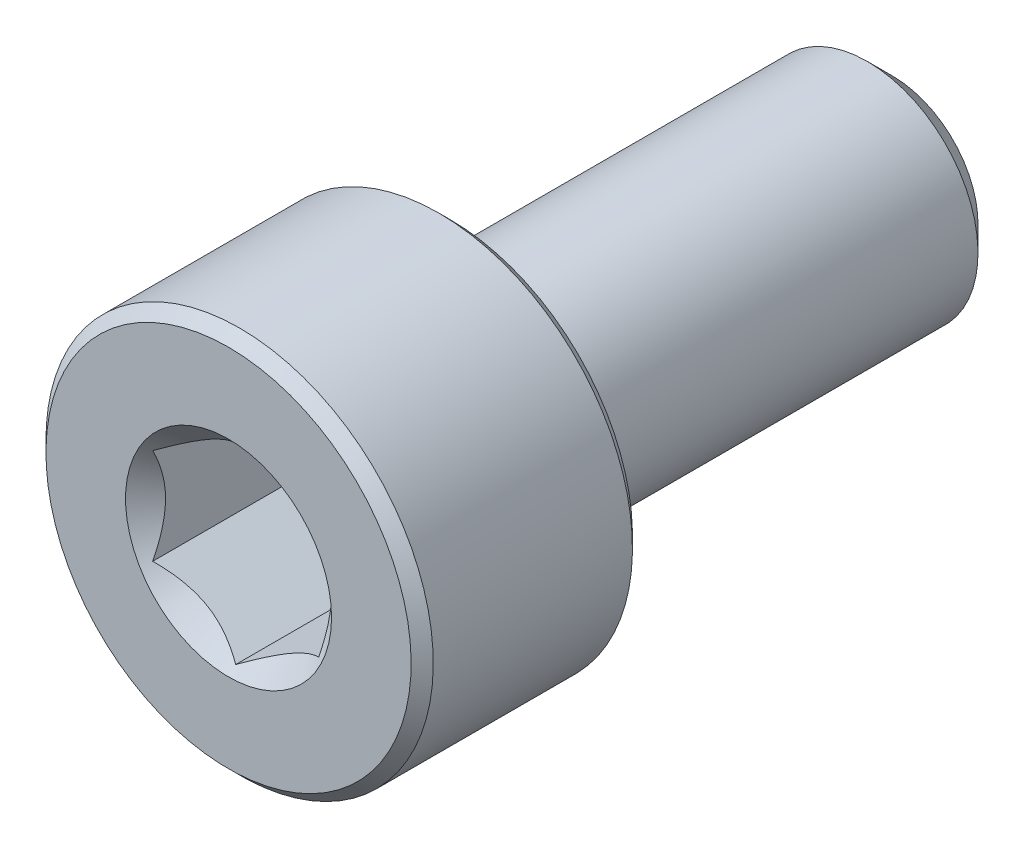
ISO-10303-21;
HEADER;
FILE_DESCRIPTION(('STEP AP214'),'2;1');
FILE_NAME('part.step','',(''),(''),'','','');
FILE_SCHEMA(('AUTOMOTIVE_DESIGN { 1 0 10303 214 1 1 1 1 }'));
ENDSEC;
DATA;
#1=APPLICATION_CONTEXT('core data for automotive mechanical design processes');
#2=APPLICATION_PROTOCOL_DEFINITION('international standard','automotive_design',2000,#1);
#3=PRODUCT_CONTEXT('',#1,'mechanical');
#4=PRODUCT('Part','Part','',(#3));
#5=PRODUCT_RELATED_PRODUCT_CATEGORY('part','',(#4));
#6=PRODUCT_DEFINITION_FORMATION('','',#4);
#7=PRODUCT_DEFINITION_CONTEXT('part definition',#1,'design');
#8=PRODUCT_DEFINITION('design','',#6,#7);
#9=PRODUCT_DEFINITION_SHAPE('','',#8);
#10=(LENGTH_UNIT() NAMED_UNIT(*) SI_UNIT(.MILLI.,.METRE.));
#11=(NAMED_UNIT(*) PLANE_ANGLE_UNIT() SI_UNIT($,.RADIAN.));
#12=(NAMED_UNIT(*) SI_UNIT($,.STERADIAN.) SOLID_ANGLE_UNIT());
#13=UNCERTAINTY_MEASURE_WITH_UNIT(LENGTH_MEASURE(1.E-05),#10,'distance_accuracy_value','');
#14=(GEOMETRIC_REPRESENTATION_CONTEXT(3) GLOBAL_UNCERTAINTY_ASSIGNED_CONTEXT((#13)) GLOBAL_UNIT_ASSIGNED_CONTEXT((#10,
#11,#12)) REPRESENTATION_CONTEXT('',''));
#15=CARTESIAN_POINT('',(0.,0.,0.));
#16=DIRECTION('',(0.,0.,1.));
#17=DIRECTION('',(1.,0.,0.));
#18=AXIS2_PLACEMENT_3D('',#15,#16,#17);
#19=CARTESIAN_POINT('',(0.,1.54533666301317,-6.));
#20=DIRECTION('',(0.,0.,-1.));
#21=DIRECTION('',(0.,1.,0.));
#22=AXIS2_PLACEMENT_3D('',#19,#20,#21);
#23=PLANE('',#22);
#24=CARTESIAN_POINT('',(0.,0.,-6.));
#25=DIRECTION('',(0.,0.,-1.));
#26=DIRECTION('',(0.,1.,0.));
#27=AXIS2_PLACEMENT_3D('',#24,#25,#26);
#28=CIRCLE('',#27,1.54533666301317);
#29=CARTESIAN_POINT('',(0.,1.54533666301317,-6.));
#30=VERTEX_POINT('',#29);
#31=EDGE_CURVE('E55',#30,#30,#28,.T.);
#32=ORIENTED_EDGE('',*,*,#31,.T.);
#33=EDGE_LOOP('',(#32));
#34=FACE_BOUND('',#33,.T.);
#35=ADVANCED_FACE('F41',(#34),#23,.T.);
#36=CARTESIAN_POINT('',(0.,0.,-6.));
#37=DIRECTION('',(0.,0.,1.));
#38=DIRECTION('',(0.,-1.,0.));
#39=AXIS2_PLACEMENT_3D('',#36,#37,#38);
#40=CONICAL_SURFACE('',#39,1.54533666301317,0.785398163397446);
#41=CARTESIAN_POINT('',(0.,0.,-5.54533666301316));
#42=DIRECTION('',(0.,0.,-1.));
#43=DIRECTION('',(0.,1.,0.));
#44=AXIS2_PLACEMENT_3D('',#41,#42,#43);
#45=CIRCLE('',#44,2.);
#46=CARTESIAN_POINT('',(0.,2.,-5.54533666301316));
#47=VERTEX_POINT('',#46);
#48=EDGE_CURVE('E173',#47,#47,#45,.T.);
#49=ORIENTED_EDGE('',*,*,#48,.T.);
#50=EDGE_LOOP('',(#49));
#51=FACE_BOUND('',#50,.T.);
#52=ORIENTED_EDGE('',*,*,#31,.F.);
#53=EDGE_LOOP('',(#52));
#54=FACE_BOUND('',#53,.T.);
#55=ADVANCED_FACE('F181',(#51,#54),#40,.T.);
#56=CARTESIAN_POINT('',(0.,0.,-6.));
#57=DIRECTION('',(0.,0.,-1.));
#58=DIRECTION('',(0.,1.,0.));
#59=AXIS2_PLACEMENT_3D('',#56,#57,#58);
#60=CYLINDRICAL_SURFACE('',#59,2.);
#61=CARTESIAN_POINT('',(0.,0.,1.8));
#62=DIRECTION('',(0.,0.,-1.));
#63=DIRECTION('',(0.,1.,0.));
#64=AXIS2_PLACEMENT_3D('',#61,#62,#63);
#65=CIRCLE('',#64,2.);
#66=CARTESIAN_POINT('',(0.,2.,1.8));
#67=VERTEX_POINT('',#66);
#68=EDGE_CURVE('E169',#67,#67,#65,.T.);
#69=ORIENTED_EDGE('',*,*,#68,.T.);
#70=EDGE_LOOP('',(#69));
#71=FACE_BOUND('',#70,.T.);
#72=ORIENTED_EDGE('',*,*,#48,.F.);
#73=EDGE_LOOP('',(#72));
#74=FACE_BOUND('',#73,.T.);
#75=ADVANCED_FACE('F183',(#71,#74),#60,.T.);
#76=CARTESIAN_POINT('',(0.,0.,1.8));
#77=DIRECTION('',(0.,0.,-1.));
#78=DIRECTION('',(0.,1.,0.));
#79=AXIS2_PLACEMENT_3D('',#76,#77,#78);
#80=TOROIDAL_SURFACE('',#79,2.2,0.2);
#81=CARTESIAN_POINT('',(0.,0.,2.));
#82=DIRECTION('',(0.,0.,-1.));
#83=DIRECTION('',(0.,1.,0.));
#84=AXIS2_PLACEMENT_3D('',#81,#82,#83);
#85=CIRCLE('',#84,2.2);
#86=CARTESIAN_POINT('',(0.,2.2,2.));
#87=VERTEX_POINT('',#86);
#88=EDGE_CURVE('E165',#87,#87,#85,.T.);
#89=ORIENTED_EDGE('',*,*,#88,.T.);
#90=EDGE_LOOP('',(#89));
#91=FACE_BOUND('',#90,.T.);
#92=ORIENTED_EDGE('',*,*,#68,.F.);
#93=EDGE_LOOP('',(#92));
#94=FACE_BOUND('',#93,.T.);
#95=ADVANCED_FACE('F189',(#91,#94),#80,.F.);
#96=CARTESIAN_POINT('',(0.,3.3,2.));
#97=DIRECTION('',(0.,0.,-1.));
#98=DIRECTION('',(0.,1.,0.));
#99=AXIS2_PLACEMENT_3D('',#96,#97,#98);
#100=PLANE('',#99);
#101=CARTESIAN_POINT('',(0.,0.,2.));
#102=DIRECTION('',(0.,0.,-1.));
#103=DIRECTION('',(0.,1.,0.));
#104=AXIS2_PLACEMENT_3D('',#101,#102,#103);
#105=CIRCLE('',#104,3.3);
#106=CARTESIAN_POINT('',(0.,3.3,2.));
#107=VERTEX_POINT('',#106);
#108=EDGE_CURVE('E161',#107,#107,#105,.T.);
#109=ORIENTED_EDGE('',*,*,#108,.T.);
#110=EDGE_LOOP('',(#109));
#111=FACE_BOUND('',#110,.T.);
#112=ORIENTED_EDGE('',*,*,#88,.F.);
#113=EDGE_LOOP('',(#112));
#114=FACE_BOUND('',#113,.T.);
#115=ADVANCED_FACE('F195',(#111,#114),#100,.T.);
#116=CARTESIAN_POINT('',(0.,0.,2.));
#117=DIRECTION('',(0.,0.,1.));
#118=DIRECTION('',(0.,-1.,0.));
#119=AXIS2_PLACEMENT_3D('',#116,#117,#118);
#120=CONICAL_SURFACE('',#119,3.3,0.785398163397447);
#121=CARTESIAN_POINT('',(0.,0.,2.2));
#122=DIRECTION('',(0.,0.,-1.));
#123=DIRECTION('',(0.,1.,0.));
#124=AXIS2_PLACEMENT_3D('',#121,#122,#123);
#125=CIRCLE('',#124,3.5);
#126=CARTESIAN_POINT('',(0.,3.5,2.2));
#127=VERTEX_POINT('',#126);
#128=EDGE_CURVE('E157',#127,#127,#125,.T.);
#129=ORIENTED_EDGE('',*,*,#128,.T.);
#130=EDGE_LOOP('',(#129));
#131=FACE_BOUND('',#130,.T.);
#132=ORIENTED_EDGE('',*,*,#108,.F.);
#133=EDGE_LOOP('',(#132));
#134=FACE_BOUND('',#133,.T.);
#135=ADVANCED_FACE('F199',(#131,#134),#120,.T.);
#136=CARTESIAN_POINT('',(0.,0.,-6.));
#137=DIRECTION('',(0.,0.,-1.));
#138=DIRECTION('',(0.,1.,0.));
#139=AXIS2_PLACEMENT_3D('',#136,#137,#138);
#140=CYLINDRICAL_SURFACE('',#139,3.5);
#141=CARTESIAN_POINT('',(0.,0.,5.8));
#142=DIRECTION('',(0.,0.,-1.));
#143=DIRECTION('',(0.,1.,0.));
#144=AXIS2_PLACEMENT_3D('',#141,#142,#143);
#145=CIRCLE('',#144,3.5);
#146=CARTESIAN_POINT('',(0.,3.5,5.8));
#147=VERTEX_POINT('',#146);
#148=EDGE_CURVE('E153',#147,#147,#145,.T.);
#149=ORIENTED_EDGE('',*,*,#148,.T.);
#150=EDGE_LOOP('',(#149));
#151=FACE_BOUND('',#150,.T.);
#152=ORIENTED_EDGE('',*,*,#128,.F.);
#153=EDGE_LOOP('',(#152));
#154=FACE_BOUND('',#153,.T.);
#155=ADVANCED_FACE('F203',(#151,#154),#140,.T.);
#156=CARTESIAN_POINT('',(0.,0.,5.8));
#157=DIRECTION('',(0.,0.,-1.));
#158=DIRECTION('',(0.,1.,0.));
#159=AXIS2_PLACEMENT_3D('',#156,#157,#158);
#160=CONICAL_SURFACE('',#159,3.5,0.785398163397447);
#161=CARTESIAN_POINT('',(0.,0.,6.));
#162=DIRECTION('',(0.,0.,-1.));
#163=DIRECTION('',(0.,1.,0.));
#164=AXIS2_PLACEMENT_3D('',#161,#162,#163);
#165=CIRCLE('',#164,3.3);
#166=CARTESIAN_POINT('',(0.,3.3,6.));
#167=VERTEX_POINT('',#166);
#168=EDGE_CURVE('E149',#167,#167,#165,.T.);
#169=ORIENTED_EDGE('',*,*,#168,.T.);
#170=EDGE_LOOP('',(#169));
#171=FACE_BOUND('',#170,.T.);
#172=ORIENTED_EDGE('',*,*,#148,.F.);
#173=EDGE_LOOP('',(#172));
#174=FACE_BOUND('',#173,.T.);
#175=ADVANCED_FACE('F207',(#171,#174),#160,.T.);
#176=CARTESIAN_POINT('',(0.,0.,6.));
#177=DIRECTION('',(0.,0.,1.));
#178=DIRECTION('',(0.,-1.,0.));
#179=AXIS2_PLACEMENT_3D('',#176,#177,#178);
#180=PLANE('',#179);
#181=CARTESIAN_POINT('',(0.,0.,6.));
#182=DIRECTION('',(0.,0.,1.));
#183=DIRECTION('',(1.,0.,0.));
#184=AXIS2_PLACEMENT_3D('',#181,#182,#183);
#185=CIRCLE('',#184,1.86195461813654);
#186=CARTESIAN_POINT('',(1.86195461813654,0.,6.));
#187=VERTEX_POINT('',#186);
#188=EDGE_CURVE('E115',#187,#187,#185,.T.);
#189=ORIENTED_EDGE('',*,*,#188,.F.);
#190=EDGE_LOOP('',(#189));
#191=FACE_BOUND('',#190,.T.);
#192=ORIENTED_EDGE('',*,*,#168,.F.);
#193=EDGE_LOOP('',(#192));
#194=FACE_BOUND('',#193,.T.);
#195=ADVANCED_FACE('F211',(#191,#194),#180,.T.);
#196=CARTESIAN_POINT('',(0.,0.,6.));
#197=DIRECTION('',(0.,0.,1.));
#198=DIRECTION('',(1.,0.,0.));
#199=AXIS2_PLACEMENT_3D('',#196,#197,#198);
#200=CONICAL_SURFACE('',#199,1.86195461813654,0.78539816339745);
#201=ORIENTED_EDGE('',*,*,#188,.T.);
#202=EDGE_LOOP('',(#201));
#203=FACE_BOUND('',#202,.T.);
#204=CARTESIAN_POINT('',(-0.000199999999999562,-1.73216627762272,5.87021167103241));
#205=CARTESIAN_POINT('',(0.051367790737076,-1.70239359975915,5.84046166549966));
#206=CARTESIAN_POINT('',(0.103797917665201,-1.67212305186355,5.81245867334265));
#207=CARTESIAN_POINT('',(0.210709034055597,-1.61039789003619,5.76118541987248));
#208=CARTESIAN_POINT('',(0.265200195814661,-1.57893740312614,5.73794369447671));
#209=CARTESIAN_POINT('',(0.375079081357249,-1.51549879897987,5.69812991842455));
#210=CARTESIAN_POINT('',(0.4304388090952,-1.4835368452681,5.68145777510323));
#211=CARTESIAN_POINT('',(0.542377257477151,-1.41890915196211,5.65577064625044));
#212=CARTESIAN_POINT('',(0.598952556553009,-1.38624538781118,5.6467364799112));
#213=CARTESIAN_POINT('',(0.696455389516441,-1.32995210095299,5.63858527065919));
#214=CARTESIAN_POINT('',(0.737256908280467,-1.30639533311124,5.63737844242155));
#215=CARTESIAN_POINT('',(0.818787969615859,-1.25932335290193,5.6394102465946));
#216=CARTESIAN_POINT('',(0.859517494314631,-1.23580815085313,5.64264986018064));
#217=CARTESIAN_POINT('',(0.940584402163417,-1.18900414978427,5.6533881754143));
#218=CARTESIAN_POINT('',(0.980921384598289,-1.1657155821172,5.66089084245107));
#219=CARTESIAN_POINT('',(1.06091833691403,-1.11952932016335,5.67974780136062));
#220=CARTESIAN_POINT('',(1.10057800851621,-1.09663179808786,5.69110374645092));
#221=CARTESIAN_POINT('',(1.20216313477449,-1.03798159809698,5.72481783702501));
#222=CARTESIAN_POINT('',(1.26345855370969,-1.00259267147465,5.7497180385257));
#223=CARTESIAN_POINT('',(1.35358562846331,-0.950557780604375,5.79175284270391));
#224=CARTESIAN_POINT('',(1.38328513990772,-0.933410759677147,5.80652134299143));
#225=CARTESIAN_POINT('',(1.44213790138375,-0.899432101996407,5.8374067553725));
#226=CARTESIAN_POINT('',(1.47129140422064,-0.88260031928571,5.85352302355404));
#227=CARTESIAN_POINT('',(1.5002,-0.865909933730601,5.87021167103241));
#228=B_SPLINE_CURVE_WITH_KNOTS('',3,(#204,#205,#206,#207,#208,#209,#210,#211,#212,#213,#214,
#215,#216,#217,#218,#219,#220,#221,#222,#223,#224,#225,#226,#227),.UNSPECIFIED.,.F.,.F.,(4,2,2,
2,2,2,2,2,2,2,2,4),(0.,0.199829143693305,0.400822987382388,0.598623720538181,0.79592624018889,
0.937113067959882,1.07833105577193,1.21968061668222,1.36109089931054,1.58570969637565,
1.69770705470964,1.80965120737194),.UNSPECIFIED.);
#229=CARTESIAN_POINT('',(0.,-1.73205080756888,5.87009618943233));
#230=VERTEX_POINT('',#229);
#231=CARTESIAN_POINT('',(1.5,-0.866025403784439,5.87009618943233));
#232=VERTEX_POINT('',#231);
#233=EDGE_CURVE('E12',#230,#232,#228,.T.);
#234=ORIENTED_EDGE('',*,*,#233,.F.);
#235=CARTESIAN_POINT('',(-1.5002,-0.865909933730601,5.87021167103241));
#236=CARTESIAN_POINT('',(-1.44863220926292,-0.895682611594166,5.84046166549966));
#237=CARTESIAN_POINT('',(-1.3962020823348,-0.925953159489765,5.81245867334265));
#238=CARTESIAN_POINT('',(-1.2892909659444,-0.987678321317124,5.76118541987248));
#239=CARTESIAN_POINT('',(-1.23479980418534,-1.01913880822718,5.73794369447671));
#240=CARTESIAN_POINT('',(-1.12492091864275,-1.08257741237344,5.69812991842455));
#241=CARTESIAN_POINT('',(-1.0695611909048,-1.11453936608521,5.68145777510323));
#242=CARTESIAN_POINT('',(-0.957622742522849,-1.1791670593912,5.65577064625044));
#243=CARTESIAN_POINT('',(-0.901047443446991,-1.21183082354213,5.6467364799112));
#244=CARTESIAN_POINT('',(-0.803544610483559,-1.26812411040032,5.63858527065919));
#245=CARTESIAN_POINT('',(-0.762743091719534,-1.29168087824208,5.63737844242155));
#246=CARTESIAN_POINT('',(-0.681212030384142,-1.33875285845138,5.6394102465946));
#247=CARTESIAN_POINT('',(-0.64048250568537,-1.36226806050018,5.64264986018064));
#248=CARTESIAN_POINT('',(-0.559415597836584,-1.40907206156905,5.6533881754143));
#249=CARTESIAN_POINT('',(-0.519078615401712,-1.43236062923612,5.66089084245107));
#250=CARTESIAN_POINT('',(-0.439081663085969,-1.47854689118996,5.67974780136062));
#251=CARTESIAN_POINT('',(-0.399421991483792,-1.50144441326545,5.69110374645092));
#252=CARTESIAN_POINT('',(-0.297836865225515,-1.56009461325633,5.72481783702501));
#253=CARTESIAN_POINT('',(-0.236541446290311,-1.59548353987866,5.7497180385257));
#254=CARTESIAN_POINT('',(-0.146414371536686,-1.64751843074894,5.79175284270391));
#255=CARTESIAN_POINT('',(-0.116714860092282,-1.66466545167617,5.80652134299143));
#256=CARTESIAN_POINT('',(-0.0578620986162482,-1.69864410935691,5.8374067553725));
#257=CARTESIAN_POINT('',(-0.0287085957793619,-1.71547589206761,5.85352302355404));
#258=CARTESIAN_POINT('',(0.00020000000000074,-1.73216627762272,5.87021167103241));
#259=B_SPLINE_CURVE_WITH_KNOTS('',3,(#235,#236,#237,#238,#239,#240,#241,#242,#243,#244,#245,
#246,#247,#248,#249,#250,#251,#252,#253,#254,#255,#256,#257,#258),.UNSPECIFIED.,.F.,.F.,(4,2,2,
2,2,2,2,2,2,2,2,4),(0.,0.199829143693305,0.400822987382388,0.598623720538181,0.795926240188889,
0.937113067959881,1.07833105577193,1.21968061668222,1.36109089931054,1.58570969637566,
1.69770705470964,1.80965120737194),.UNSPECIFIED.);
#260=CARTESIAN_POINT('',(-1.5,-0.866025403784439,5.87009618943233));
#261=VERTEX_POINT('',#260);
#262=EDGE_CURVE('E100',#261,#230,#259,.T.);
#263=ORIENTED_EDGE('',*,*,#262,.F.);
#264=CARTESIAN_POINT('',(-1.5,-1.81798631684901,6.49496588290931));
#265=CARTESIAN_POINT('',(-1.5,-1.77410479833239,6.46112335419702));
#266=CARTESIAN_POINT('',(-1.5,-1.72998897047494,6.42758561768896));
#267=CARTESIAN_POINT('',(-1.5,-1.64119029432319,6.36124817349268));
#268=CARTESIAN_POINT('',(-1.5,-1.59650731534755,6.328448640911));
#269=CARTESIAN_POINT('',(-1.5,-1.460806940489,6.23088193148043));
#270=CARTESIAN_POINT('',(-1.5,-1.36880251235632,6.1674654206559));
#271=CARTESIAN_POINT('',(-1.5,-1.17526237686872,6.04210237172158));
#272=CARTESIAN_POINT('',(-1.5,-1.07349393006072,5.98051141536721));
#273=CARTESIAN_POINT('',(-1.5,-0.864764842560628,5.86725220599653));
#274=CARTESIAN_POINT('',(-1.5,-0.75782333444995,5.81555043950584));
#275=CARTESIAN_POINT('',(-1.5,-0.598146069886858,5.75227317361643));
#276=CARTESIAN_POINT('',(-1.5,-0.547969945491557,5.73427408399123));
#277=CARTESIAN_POINT('',(-1.5,-0.446326869364775,5.70229546522083));
#278=CARTESIAN_POINT('',(-1.5,-0.394859836419925,5.6883161896624));
#279=CARTESIAN_POINT('',(-1.5,-0.291848397493325,5.66536569037263));
#280=CARTESIAN_POINT('',(-1.5,-0.240324749628771,5.65630281543282));
#281=CARTESIAN_POINT('',(-1.5,-0.13662544851591,5.64337711521516));
#282=CARTESIAN_POINT('',(-1.5,-0.0844499362377799,5.6395131846234));
#283=CARTESIAN_POINT('',(-1.5,0.0176806967011132,5.63731961256892));
#284=CARTESIAN_POINT('',(-1.5,0.0676307045116618,5.63875006923659));
#285=CARTESIAN_POINT('',(-1.5,0.16714547763776,5.64651331423855));
#286=CARTESIAN_POINT('',(-1.5,0.216710207908513,5.6528465433779));
#287=CARTESIAN_POINT('',(-1.5,0.315937150651982,5.67016271707146));
#288=CARTESIAN_POINT('',(-1.5,0.365584733694539,5.68122815181031));
#289=CARTESIAN_POINT('',(-1.5,0.46378160619877,5.70739349919907));
#290=CARTESIAN_POINT('',(-1.5,0.512330953840259,5.72249319758548));
#291=CARTESIAN_POINT('',(-1.5,0.66131302328769,5.77461385569168));
#292=CARTESIAN_POINT('',(-1.5,0.759720789706277,5.81740496304236));
#293=CARTESIAN_POINT('',(-1.5,0.95194266902277,5.91263883721007));
#294=CARTESIAN_POINT('',(-1.5,1.04573912191844,5.96511552648595));
#295=CARTESIAN_POINT('',(-1.5,1.22504153577549,6.0734783373155));
#296=CARTESIAN_POINT('',(-1.5,1.3107282773288,6.12906910554414));
#297=CARTESIAN_POINT('',(-1.5,1.43696960041027,6.21505045621636));
#298=CARTESIAN_POINT('',(-1.5,1.47850725450332,6.24402268297088));
#299=CARTESIAN_POINT('',(-1.5,1.56101250374723,6.30274488393776));
#300=CARTESIAN_POINT('',(-1.5,1.60198025290925,6.3324946415183));
#301=CARTESIAN_POINT('',(-1.5,1.64271029717086,6.36256715528604));
#302=B_SPLINE_CURVE_WITH_KNOTS('',3,(#264,#265,#266,#267,#268,#269,#270,#271,#272,#273,#274,
#275,#276,#277,#278,#279,#280,#281,#282,#283,#284,#285,#286,#287,#288,#289,#290,#291,#292,#293,
#294,#295,#296,#297,#298,#299,#300,#301),.UNSPECIFIED.,.F.,.F.,(4,2,2,2,2,2,2,2,2,2,2,2,2,2,2,2,
2,2,4),(0.,0.166243250325255,0.332525527595494,0.667617582874064,1.02421660314856,
1.37958485991001,1.53937185590113,1.69916892971772,1.85587466130012,2.01254707142443,
2.16220898927398,2.31188436469119,2.46428258498153,2.61667271286895,2.93766301623296,
3.25979964661299,3.56606529199603,3.71798989158865,3.86987260467919),.UNSPECIFIED.);
#303=CARTESIAN_POINT('',(-1.5,0.866025403784439,5.87009618943233));
#304=VERTEX_POINT('',#303);
#305=EDGE_CURVE('E114',#304,#261,#302,.F.);
#306=ORIENTED_EDGE('',*,*,#305,.F.);
#307=CARTESIAN_POINT('',(0.00019999999999977,1.73216627762272,5.87021167103241));
#308=CARTESIAN_POINT('',(-0.0513677907370758,1.70239359975915,5.84046166549966));
#309=CARTESIAN_POINT('',(-0.103797917665201,1.67212305186355,5.81245867334265));
#310=CARTESIAN_POINT('',(-0.210709034055597,1.61039789003619,5.76118541987248));
#311=CARTESIAN_POINT('',(-0.265200195814661,1.57893740312614,5.73794369447671));
#312=CARTESIAN_POINT('',(-0.375079081357249,1.51549879897987,5.69812991842455));
#313=CARTESIAN_POINT('',(-0.4304388090952,1.4835368452681,5.68145777510323));
#314=CARTESIAN_POINT('',(-0.542377257477151,1.41890915196211,5.65577064625044));
#315=CARTESIAN_POINT('',(-0.598952556553009,1.38624538781118,5.6467364799112));
#316=CARTESIAN_POINT('',(-0.696455389516441,1.32995210095299,5.63858527065919));
#317=CARTESIAN_POINT('',(-0.737256908280467,1.30639533311124,5.63737844242155));
#318=CARTESIAN_POINT('',(-0.818787969615859,1.25932335290193,5.6394102465946));
#319=CARTESIAN_POINT('',(-0.859517494314631,1.23580815085313,5.64264986018064));
#320=CARTESIAN_POINT('',(-0.940584402163417,1.18900414978427,5.6533881754143));
#321=CARTESIAN_POINT('',(-0.980921384598289,1.16571558211719,5.66089084245107));
#322=CARTESIAN_POINT('',(-1.06091833691403,1.11952932016335,5.67974780136062));
#323=CARTESIAN_POINT('',(-1.10057800851621,1.09663179808786,5.69110374645092));
#324=CARTESIAN_POINT('',(-1.20216313477449,1.03798159809698,5.72481783702501));
#325=CARTESIAN_POINT('',(-1.26345855370969,1.00259267147465,5.7497180385257));
#326=CARTESIAN_POINT('',(-1.35358562846331,0.950557780604374,5.79175284270391));
#327=CARTESIAN_POINT('',(-1.38328513990772,0.933410759677147,5.80652134299143));
#328=CARTESIAN_POINT('',(-1.44213790138375,0.899432101996406,5.8374067553725));
#329=CARTESIAN_POINT('',(-1.47129140422064,0.88260031928571,5.85352302355404));
#330=CARTESIAN_POINT('',(-1.5002,0.865909933730601,5.87021167103241));
#331=B_SPLINE_CURVE_WITH_KNOTS('',3,(#307,#308,#309,#310,#311,#312,#313,#314,#315,#316,#317,
#318,#319,#320,#321,#322,#323,#324,#325,#326,#327,#328,#329,#330),.UNSPECIFIED.,.F.,.F.,(4,2,2,
2,2,2,2,2,2,2,2,4),(0.,0.199829143693305,0.400822987382389,0.598623720538181,0.79592624018889,
0.937113067959882,1.07833105577193,1.21968061668222,1.36109089931055,1.58570969637566,
1.69770705470964,1.80965120737194),.UNSPECIFIED.);
#332=CARTESIAN_POINT('',(0.,1.73205080756888,5.87009618943233));
#333=VERTEX_POINT('',#332);
#334=EDGE_CURVE('E262',#333,#304,#331,.T.);
#335=ORIENTED_EDGE('',*,*,#334,.F.);
#336=CARTESIAN_POINT('',(1.5002,0.865909933730601,5.87021167103241));
#337=CARTESIAN_POINT('',(1.44863220926292,0.895682611594166,5.84046166549966));
#338=CARTESIAN_POINT('',(1.3962020823348,0.925953159489765,5.81245867334265));
#339=CARTESIAN_POINT('',(1.2892909659444,0.987678321317124,5.76118541987248));
#340=CARTESIAN_POINT('',(1.23479980418534,1.01913880822718,5.73794369447671));
#341=CARTESIAN_POINT('',(1.12492091864275,1.08257741237344,5.69812991842455));
#342=CARTESIAN_POINT('',(1.0695611909048,1.11453936608521,5.68145777510323));
#343=CARTESIAN_POINT('',(0.957622742522849,1.1791670593912,5.65577064625044));
#344=CARTESIAN_POINT('',(0.901047443446991,1.21183082354213,5.6467364799112));
#345=CARTESIAN_POINT('',(0.803544610483559,1.26812411040032,5.63858527065919));
#346=CARTESIAN_POINT('',(0.762743091719534,1.29168087824208,5.63737844242155));
#347=CARTESIAN_POINT('',(0.681212030384142,1.33875285845138,5.6394102465946));
#348=CARTESIAN_POINT('',(0.64048250568537,1.36226806050018,5.64264986018064));
#349=CARTESIAN_POINT('',(0.559415597836584,1.40907206156905,5.6533881754143));
#350=CARTESIAN_POINT('',(0.519078615401712,1.43236062923612,5.66089084245107));
#351=CARTESIAN_POINT('',(0.439081663085969,1.47854689118996,5.67974780136062));
#352=CARTESIAN_POINT('',(0.399421991483792,1.50144441326545,5.69110374645092));
#353=CARTESIAN_POINT('',(0.297836865225515,1.56009461325633,5.72481783702501));
#354=CARTESIAN_POINT('',(0.23654144629031,1.59548353987866,5.7497180385257));
#355=CARTESIAN_POINT('',(0.146414371536686,1.64751843074894,5.79175284270391));
#356=CARTESIAN_POINT('',(0.116714860092281,1.66466545167617,5.80652134299143));
#357=CARTESIAN_POINT('',(0.0578620986162482,1.69864410935691,5.8374067553725));
#358=CARTESIAN_POINT('',(0.028708595779362,1.71547589206761,5.85352302355404));
#359=CARTESIAN_POINT('',(-0.000200000000000716,1.73216627762272,5.87021167103241));
#360=B_SPLINE_CURVE_WITH_KNOTS('',3,(#336,#337,#338,#339,#340,#341,#342,#343,#344,#345,#346,
#347,#348,#349,#350,#351,#352,#353,#354,#355,#356,#357,#358,#359),.UNSPECIFIED.,.F.,.F.,(4,2,2,
2,2,2,2,2,2,2,2,4),(0.,0.199829143693305,0.400822987382389,0.598623720538181,0.795926240188889,
0.937113067959881,1.07833105577193,1.21968061668222,1.36109089931054,1.58570969637566,
1.69770705470964,1.80965120737194),.UNSPECIFIED.);
#361=CARTESIAN_POINT('',(1.5,0.866025403784439,5.87009618943233));
#362=VERTEX_POINT('',#361);
#363=EDGE_CURVE('E235',#362,#333,#360,.T.);
#364=ORIENTED_EDGE('',*,*,#363,.F.);
#365=CARTESIAN_POINT('',(1.5,-1.81798631684901,6.49496588290931));
#366=CARTESIAN_POINT('',(1.5,-1.77410479833239,6.46112335419702));
#367=CARTESIAN_POINT('',(1.5,-1.72998897047494,6.42758561768896));
#368=CARTESIAN_POINT('',(1.5,-1.64119029432319,6.36124817349268));
#369=CARTESIAN_POINT('',(1.5,-1.59650731534755,6.328448640911));
#370=CARTESIAN_POINT('',(1.5,-1.460806940489,6.23088193148043));
#371=CARTESIAN_POINT('',(1.5,-1.36880251235632,6.1674654206559));
#372=CARTESIAN_POINT('',(1.5,-1.17526237686872,6.04210237172158));
#373=CARTESIAN_POINT('',(1.5,-1.07349393006072,5.98051141536721));
#374=CARTESIAN_POINT('',(1.5,-0.864764842560628,5.86725220599653));
#375=CARTESIAN_POINT('',(1.5,-0.757823334449949,5.81555043950584));
#376=CARTESIAN_POINT('',(1.5,-0.598146069886857,5.75227317361643));
#377=CARTESIAN_POINT('',(1.5,-0.547969945491557,5.73427408399123));
#378=CARTESIAN_POINT('',(1.5,-0.446326869364774,5.70229546522083));
#379=CARTESIAN_POINT('',(1.5,-0.394859836419925,5.6883161896624));
#380=CARTESIAN_POINT('',(1.5,-0.291848397493325,5.66536569037263));
#381=CARTESIAN_POINT('',(1.5,-0.240324749628771,5.65630281543282));
#382=CARTESIAN_POINT('',(1.5,-0.13662544851591,5.64337711521516));
#383=CARTESIAN_POINT('',(1.5,-0.0844499362377801,5.6395131846234));
#384=CARTESIAN_POINT('',(1.5,0.017680696701113,5.63731961256892));
#385=CARTESIAN_POINT('',(1.5,0.0676307045116617,5.63875006923659));
#386=CARTESIAN_POINT('',(1.5,0.16714547763776,5.64651331423855));
#387=CARTESIAN_POINT('',(1.5,0.216710207908513,5.6528465433779));
#388=CARTESIAN_POINT('',(1.5,0.315937150651982,5.67016271707146));
#389=CARTESIAN_POINT('',(1.5,0.365584733694538,5.68122815181031));
#390=CARTESIAN_POINT('',(1.5,0.463781606198769,5.70739349919907));
#391=CARTESIAN_POINT('',(1.5,0.512330953840258,5.72249319758548));
#392=CARTESIAN_POINT('',(1.5,0.66131302328769,5.77461385569168));
#393=CARTESIAN_POINT('',(1.5,0.759720789706276,5.81740496304236));
#394=CARTESIAN_POINT('',(1.5,0.951942669022769,5.91263883721007));
#395=CARTESIAN_POINT('',(1.5,1.04573912191844,5.96511552648595));
#396=CARTESIAN_POINT('',(1.5,1.22504153577548,6.07347833731549));
#397=CARTESIAN_POINT('',(1.5,1.3107282773288,6.12906910554413));
#398=CARTESIAN_POINT('',(1.5,1.43696960041027,6.21505045621636));
#399=CARTESIAN_POINT('',(1.5,1.47850725450332,6.24402268297088));
#400=CARTESIAN_POINT('',(1.5,1.56101250374723,6.30274488393776));
#401=CARTESIAN_POINT('',(1.5,1.60198025290925,6.3324946415183));
#402=CARTESIAN_POINT('',(1.5,1.64271029717086,6.36256715528604));
#403=B_SPLINE_CURVE_WITH_KNOTS('',3,(#365,#366,#367,#368,#369,#370,#371,#372,#373,#374,#375,
#376,#377,#378,#379,#380,#381,#382,#383,#384,#385,#386,#387,#388,#389,#390,#391,#392,#393,#394,
#395,#396,#397,#398,#399,#400,#401,#402),.UNSPECIFIED.,.F.,.F.,(4,2,2,2,2,2,2,2,2,2,2,2,2,2,2,2,
2,2,4),(0.,0.166243250325254,0.332525527595493,0.667617582874062,1.02421660314856,
1.37958485991001,1.53937185590113,1.69916892971772,1.85587466130012,2.01254707142443,
2.16220898927398,2.31188436469119,2.46428258498153,2.61667271286895,2.93766301623296,
3.25979964661299,3.56606529199602,3.71798989158864,3.86987260467919),.UNSPECIFIED.);
#404=EDGE_CURVE('E62',#232,#362,#403,.T.);
#405=ORIENTED_EDGE('',*,*,#404,.F.);
#406=EDGE_LOOP('',(#234,#263,#306,#335,#364,#405));
#407=FACE_BOUND('',#406,.T.);
#408=ADVANCED_FACE('F99',(#203,#407),#200,.F.);
#409=CARTESIAN_POINT('',(0.,3.3,3.));
#410=DIRECTION('',(0.,0.,-1.));
#411=DIRECTION('',(0.,1.,0.));
#412=AXIS2_PLACEMENT_3D('',#409,#410,#411);
#413=PLANE('',#412);
#414=DIRECTION('',(0.866025403784438,0.5,0.));
#415=VECTOR('',#414,1.);
#416=CARTESIAN_POINT('',(0.,-1.73205080756888,3.));
#417=LINE('',#416,#415);
#418=CARTESIAN_POINT('',(0.,-1.73205080756888,3.));
#419=VERTEX_POINT('',#418);
#420=CARTESIAN_POINT('',(1.5,-0.866025403784439,3.));
#421=VERTEX_POINT('',#420);
#422=EDGE_CURVE('E118',#419,#421,#417,.T.);
#423=ORIENTED_EDGE('',*,*,#422,.T.);
#424=DIRECTION('',(0.,1.,0.));
#425=VECTOR('',#424,1.);
#426=CARTESIAN_POINT('',(1.5,-0.866025403784439,3.));
#427=LINE('',#426,#425);
#428=CARTESIAN_POINT('',(1.5,0.866025403784439,3.));
#429=VERTEX_POINT('',#428);
#430=EDGE_CURVE('E69',#421,#429,#427,.T.);
#431=ORIENTED_EDGE('',*,*,#430,.T.);
#432=DIRECTION('',(-0.866025403784439,0.5,0.));
#433=VECTOR('',#432,1.);
#434=CARTESIAN_POINT('',(1.5,0.866025403784439,3.));
#435=LINE('',#434,#433);
#436=CARTESIAN_POINT('',(0.,1.73205080756888,3.));
#437=VERTEX_POINT('',#436);
#438=EDGE_CURVE('E129',#429,#437,#435,.T.);
#439=ORIENTED_EDGE('',*,*,#438,.T.);
#440=DIRECTION('',(-0.866025403784439,-0.5,0.));
#441=VECTOR('',#440,1.);
#442=CARTESIAN_POINT('',(0.,1.73205080756888,3.));
#443=LINE('',#442,#441);
#444=CARTESIAN_POINT('',(-1.5,0.866025403784439,3.));
#445=VERTEX_POINT('',#444);
#446=EDGE_CURVE('E138',#437,#445,#443,.T.);
#447=ORIENTED_EDGE('',*,*,#446,.T.);
#448=DIRECTION('',(0.,-1.,0.));
#449=VECTOR('',#448,1.);
#450=CARTESIAN_POINT('',(-1.5,0.866025403784438,3.));
#451=LINE('',#450,#449);
#452=CARTESIAN_POINT('',(-1.5,-0.866025403784439,3.));
#453=VERTEX_POINT('',#452);
#454=EDGE_CURVE('E133',#445,#453,#451,.T.);
#455=ORIENTED_EDGE('',*,*,#454,.T.);
#456=DIRECTION('',(0.866025403784439,-0.5,0.));
#457=VECTOR('',#456,1.);
#458=CARTESIAN_POINT('',(-1.5,-0.866025403784439,3.));
#459=LINE('',#458,#457);
#460=EDGE_CURVE('E120',#453,#419,#459,.T.);
#461=ORIENTED_EDGE('',*,*,#460,.T.);
#462=EDGE_LOOP('',(#423,#431,#439,#447,#455,#461));
#463=FACE_BOUND('',#462,.T.);
#464=ADVANCED_FACE('F216',(#463),#413,.F.);
#465=CARTESIAN_POINT('',(0.,-1.73205080756888,-2.58257569495584));
#466=DIRECTION('',(0.5,-0.866025403784438,0.));
#467=DIRECTION('',(0.866025403784438,0.5,0.));
#468=AXIS2_PLACEMENT_3D('',#465,#466,#467);
#469=PLANE('',#468);
#470=DIRECTION('',(0.,0.,1.));
#471=VECTOR('',#470,1.);
#472=CARTESIAN_POINT('',(0.,-1.73205080756888,-2.58257569495584));
#473=LINE('',#472,#471);
#474=EDGE_CURVE('E109',#419,#230,#473,.T.);
#475=ORIENTED_EDGE('',*,*,#474,.T.);
#476=ORIENTED_EDGE('',*,*,#233,.T.);
#477=DIRECTION('',(0.,0.,1.));
#478=VECTOR('',#477,1.);
#479=CARTESIAN_POINT('',(1.5,-0.866025403784439,-2.58257569495584));
#480=LINE('',#479,#478);
#481=EDGE_CURVE('E124',#421,#232,#480,.T.);
#482=ORIENTED_EDGE('',*,*,#481,.F.);
#483=ORIENTED_EDGE('',*,*,#422,.F.);
#484=EDGE_LOOP('',(#475,#476,#482,#483));
#485=FACE_BOUND('',#484,.T.);
#486=ADVANCED_FACE('F117',(#485),#469,.F.);
#487=CARTESIAN_POINT('',(-1.5,-0.866025403784439,-2.58257569495584));
#488=DIRECTION('',(-0.5,-0.866025403784439,0.));
#489=DIRECTION('',(0.866025403784439,-0.5,0.));
#490=AXIS2_PLACEMENT_3D('',#487,#488,#489);
#491=PLANE('',#490);
#492=DIRECTION('',(0.,0.,1.));
#493=VECTOR('',#492,1.);
#494=CARTESIAN_POINT('',(-1.5,-0.866025403784439,-2.58257569495584));
#495=LINE('',#494,#493);
#496=EDGE_CURVE('E112',#453,#261,#495,.T.);
#497=ORIENTED_EDGE('',*,*,#496,.T.);
#498=ORIENTED_EDGE('',*,*,#262,.T.);
#499=ORIENTED_EDGE('',*,*,#474,.F.);
#500=ORIENTED_EDGE('',*,*,#460,.F.);
#501=EDGE_LOOP('',(#497,#498,#499,#500));
#502=FACE_BOUND('',#501,.T.);
#503=ADVANCED_FACE('F108',(#502),#491,.F.);
#504=CARTESIAN_POINT('',(-1.5,0.866025403784438,-2.58257569495584));
#505=DIRECTION('',(-1.,0.,0.));
#506=DIRECTION('',(0.,0.,1.));
#507=AXIS2_PLACEMENT_3D('',#504,#505,#506);
#508=PLANE('',#507);
#509=DIRECTION('',(0.,0.,1.));
#510=VECTOR('',#509,1.);
#511=CARTESIAN_POINT('',(-1.5,0.866025403784438,-2.58257569495584));
#512=LINE('',#511,#510);
#513=EDGE_CURVE('E134',#445,#304,#512,.T.);
#514=ORIENTED_EDGE('',*,*,#513,.T.);
#515=ORIENTED_EDGE('',*,*,#305,.T.);
#516=ORIENTED_EDGE('',*,*,#496,.F.);
#517=ORIENTED_EDGE('',*,*,#454,.F.);
#518=EDGE_LOOP('',(#514,#515,#516,#517));
#519=FACE_BOUND('',#518,.T.);
#520=ADVANCED_FACE('F272',(#519),#508,.F.);
#521=CARTESIAN_POINT('',(0.,1.73205080756888,-2.58257569495584));
#522=DIRECTION('',(-0.5,0.866025403784438,0.));
#523=DIRECTION('',(-0.866025403784439,-0.5,0.));
#524=AXIS2_PLACEMENT_3D('',#521,#522,#523);
#525=PLANE('',#524);
#526=DIRECTION('',(0.,0.,1.));
#527=VECTOR('',#526,1.);
#528=CARTESIAN_POINT('',(0.,1.73205080756888,-2.58257569495584));
#529=LINE('',#528,#527);
#530=EDGE_CURVE('E139',#437,#333,#529,.T.);
#531=ORIENTED_EDGE('',*,*,#530,.T.);
#532=ORIENTED_EDGE('',*,*,#334,.T.);
#533=ORIENTED_EDGE('',*,*,#513,.F.);
#534=ORIENTED_EDGE('',*,*,#446,.F.);
#535=EDGE_LOOP('',(#531,#532,#533,#534));
#536=FACE_BOUND('',#535,.T.);
#537=ADVANCED_FACE('F269',(#536),#525,.F.);
#538=CARTESIAN_POINT('',(1.5,0.866025403784439,-2.58257569495584));
#539=DIRECTION('',(0.5,0.866025403784439,0.));
#540=DIRECTION('',(-0.866025403784439,0.5,0.));
#541=AXIS2_PLACEMENT_3D('',#538,#539,#540);
#542=PLANE('',#541);
#543=DIRECTION('',(0.,0.,1.));
#544=VECTOR('',#543,1.);
#545=CARTESIAN_POINT('',(1.5,0.866025403784439,-2.58257569495584));
#546=LINE('',#545,#544);
#547=EDGE_CURVE('E143',#429,#362,#546,.T.);
#548=ORIENTED_EDGE('',*,*,#547,.T.);
#549=ORIENTED_EDGE('',*,*,#363,.T.);
#550=ORIENTED_EDGE('',*,*,#530,.F.);
#551=ORIENTED_EDGE('',*,*,#438,.F.);
#552=EDGE_LOOP('',(#548,#549,#550,#551));
#553=FACE_BOUND('',#552,.T.);
#554=ADVANCED_FACE('F224',(#553),#542,.F.);
#555=CARTESIAN_POINT('',(1.5,-0.866025403784439,-2.58257569495584));
#556=DIRECTION('',(1.,0.,0.));
#557=DIRECTION('',(0.,0.,-1.));
#558=AXIS2_PLACEMENT_3D('',#555,#556,#557);
#559=PLANE('',#558);
#560=ORIENTED_EDGE('',*,*,#481,.T.);
#561=ORIENTED_EDGE('',*,*,#404,.T.);
#562=ORIENTED_EDGE('',*,*,#547,.F.);
#563=ORIENTED_EDGE('',*,*,#430,.F.);
#564=EDGE_LOOP('',(#560,#561,#562,#563));
#565=FACE_BOUND('',#564,.T.);
#566=ADVANCED_FACE('F220',(#565),#559,.F.);
#567=CLOSED_SHELL('',(#35,#55,#75,#95,#115,#135,#155,#175,#195,#408,#464,#486,#503,#520,#537,
#554,#566));
#568=MANIFOLD_SOLID_BREP('B2',#567);
#569=ADVANCED_BREP_SHAPE_REPRESENTATION('',(#18,#568),#14);
#570=SHAPE_DEFINITION_REPRESENTATION(#9,#569);
ENDSEC;
END-ISO-10303-21;
